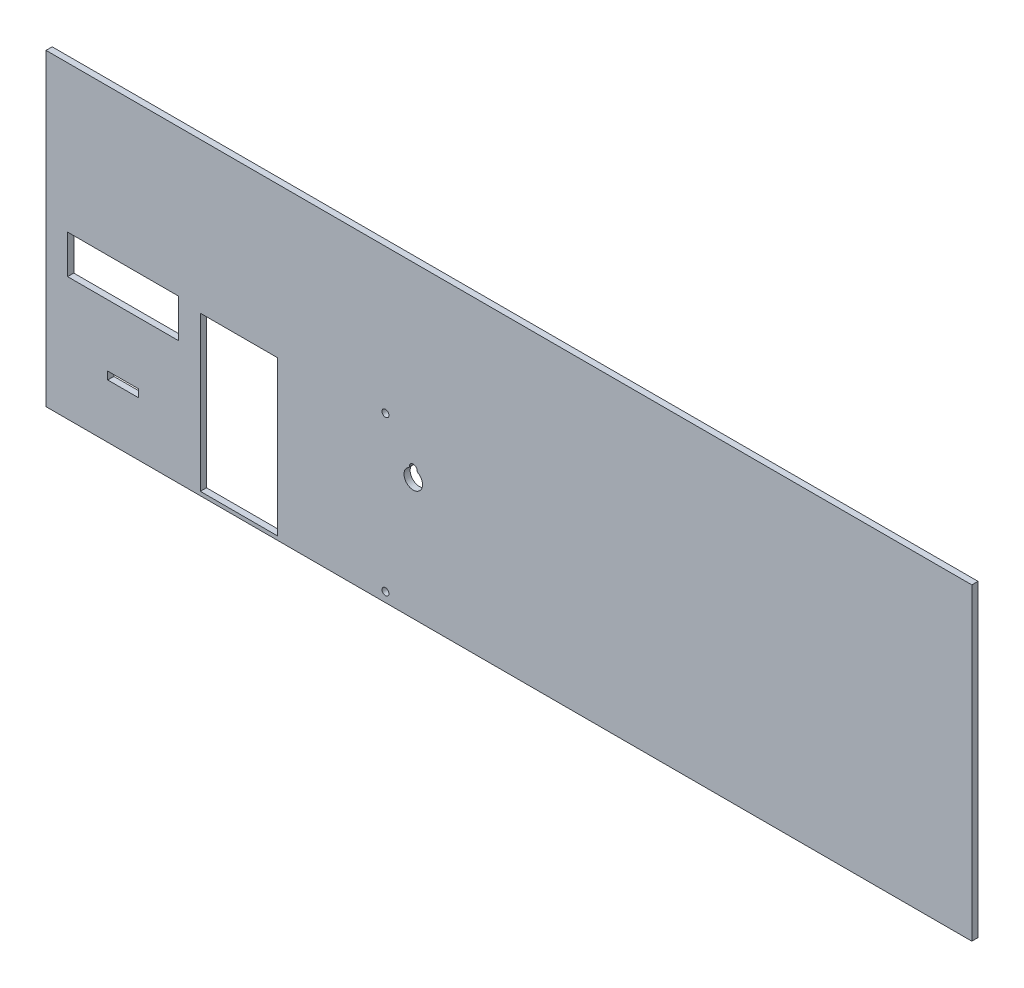
ISO-10303-21;
HEADER;
FILE_DESCRIPTION(('STEP AP214'),'2;1');
FILE_NAME('part.step','',(''),(''),'','','');
FILE_SCHEMA(('AUTOMOTIVE_DESIGN { 1 0 10303 214 1 1 1 1 }'));
ENDSEC;
DATA;
#1=APPLICATION_CONTEXT('core data for automotive mechanical design processes');
#2=APPLICATION_PROTOCOL_DEFINITION('international standard','automotive_design',2000,#1);
#3=PRODUCT_CONTEXT('',#1,'mechanical');
#4=PRODUCT('Part','Part','',(#3));
#5=PRODUCT_RELATED_PRODUCT_CATEGORY('part','',(#4));
#6=PRODUCT_DEFINITION_FORMATION('','',#4);
#7=PRODUCT_DEFINITION_CONTEXT('part definition',#1,'design');
#8=PRODUCT_DEFINITION('design','',#6,#7);
#9=PRODUCT_DEFINITION_SHAPE('','',#8);
#10=(LENGTH_UNIT() NAMED_UNIT(*) SI_UNIT(.MILLI.,.METRE.));
#11=(NAMED_UNIT(*) PLANE_ANGLE_UNIT() SI_UNIT($,.RADIAN.));
#12=(NAMED_UNIT(*) SI_UNIT($,.STERADIAN.) SOLID_ANGLE_UNIT());
#13=UNCERTAINTY_MEASURE_WITH_UNIT(LENGTH_MEASURE(1.E-05),#10,'distance_accuracy_value','');
#14=(GEOMETRIC_REPRESENTATION_CONTEXT(3) GLOBAL_UNCERTAINTY_ASSIGNED_CONTEXT((#13)) GLOBAL_UNIT_ASSIGNED_CONTEXT((#10,
#11,#12)) REPRESENTATION_CONTEXT('',''));
#15=CARTESIAN_POINT('',(0.,0.,0.));
#16=DIRECTION('',(0.,0.,1.));
#17=DIRECTION('',(1.,0.,0.));
#18=AXIS2_PLACEMENT_3D('',#15,#16,#17);
#19=CARTESIAN_POINT('',(0.,0.,4.));
#20=DIRECTION('',(0.,0.,-1.));
#21=DIRECTION('',(-1.,0.,0.));
#22=AXIS2_PLACEMENT_3D('',#19,#20,#21);
#23=PLANE('',#22);
#24=DIRECTION('',(0.,-1.,0.));
#25=VECTOR('',#24,1.);
#26=CARTESIAN_POINT('',(39.9999999999999,40.0000000000001,4.));
#27=LINE('',#26,#25);
#28=CARTESIAN_POINT('',(39.9999999999999,40.0000000000001,4.));
#29=VERTEX_POINT('',#28);
#30=CARTESIAN_POINT('',(39.9999999999999,35.0000000000001,4.));
#31=VERTEX_POINT('',#30);
#32=EDGE_CURVE('E205',#29,#31,#27,.T.);
#33=ORIENTED_EDGE('',*,*,#32,.F.);
#34=DIRECTION('',(-1.,0.,0.));
#35=VECTOR('',#34,1.);
#36=CARTESIAN_POINT('',(39.9999999999999,40.0000000000001,4.));
#37=LINE('',#36,#35);
#38=CARTESIAN_POINT('',(59.9999999999999,40.0000000000001,4.));
#39=VERTEX_POINT('',#38);
#40=EDGE_CURVE('E213',#39,#29,#37,.T.);
#41=ORIENTED_EDGE('',*,*,#40,.F.);
#42=DIRECTION('',(0.,1.,0.));
#43=VECTOR('',#42,1.);
#44=CARTESIAN_POINT('',(59.9999999999999,40.0000000000001,4.));
#45=LINE('',#44,#43);
#46=CARTESIAN_POINT('',(59.9999999999999,35.0000000000001,4.));
#47=VERTEX_POINT('',#46);
#48=EDGE_CURVE('E210',#47,#39,#45,.T.);
#49=ORIENTED_EDGE('',*,*,#48,.F.);
#50=DIRECTION('',(1.,0.,0.));
#51=VECTOR('',#50,1.);
#52=CARTESIAN_POINT('',(39.9999999999999,35.0000000000001,4.));
#53=LINE('',#52,#51);
#54=EDGE_CURVE('E207',#31,#47,#53,.T.);
#55=ORIENTED_EDGE('',*,*,#54,.F.);
#56=EDGE_LOOP('',(#33,#41,#49,#55));
#57=FACE_BOUND('',#56,.T.);
#58=CARTESIAN_POINT('',(220.,6.19033886971252,4.));
#59=DIRECTION('',(0.,0.,1.));
#60=DIRECTION('',(1.,0.,0.));
#61=AXIS2_PLACEMENT_3D('',#58,#59,#60);
#62=CIRCLE('',#61,2.25000000000001);
#63=CARTESIAN_POINT('',(222.25,6.19033886971252,4.));
#64=VERTEX_POINT('',#63);
#65=EDGE_CURVE('E267',#64,#64,#62,.T.);
#66=ORIENTED_EDGE('',*,*,#65,.F.);
#67=EDGE_LOOP('',(#66));
#68=FACE_BOUND('',#67,.T.);
#69=CARTESIAN_POINT('',(220.,106.309661130287,4.));
#70=DIRECTION('',(0.,0.,1.));
#71=DIRECTION('',(1.,0.,0.));
#72=AXIS2_PLACEMENT_3D('',#69,#70,#71);
#73=CIRCLE('',#72,2.25000000000001);
#74=CARTESIAN_POINT('',(222.25,106.309661130287,4.));
#75=VERTEX_POINT('',#74);
#76=EDGE_CURVE('E273',#75,#75,#73,.T.);
#77=ORIENTED_EDGE('',*,*,#76,.F.);
#78=EDGE_LOOP('',(#77));
#79=FACE_BOUND('',#78,.T.);
#80=DIRECTION('',(0.,1.,0.));
#81=VECTOR('',#80,1.);
#82=CARTESIAN_POINT('',(150.,102.5,4.));
#83=LINE('',#82,#81);
#84=CARTESIAN_POINT('',(150.,2.50000000000002,4.));
#85=VERTEX_POINT('',#84);
#86=CARTESIAN_POINT('',(150.,102.5,4.));
#87=VERTEX_POINT('',#86);
#88=EDGE_CURVE('E279',#85,#87,#83,.T.);
#89=ORIENTED_EDGE('',*,*,#88,.F.);
#90=DIRECTION('',(1.,0.,0.));
#91=VECTOR('',#90,1.);
#92=CARTESIAN_POINT('',(150.,2.50000000000002,4.));
#93=LINE('',#92,#91);
#94=CARTESIAN_POINT('',(99.9999999999999,2.50000000000001,4.));
#95=VERTEX_POINT('',#94);
#96=EDGE_CURVE('E287',#95,#85,#93,.T.);
#97=ORIENTED_EDGE('',*,*,#96,.F.);
#98=DIRECTION('',(0.,-1.,0.));
#99=VECTOR('',#98,1.);
#100=CARTESIAN_POINT('',(99.9999999999999,102.5,4.));
#101=LINE('',#100,#99);
#102=CARTESIAN_POINT('',(99.9999999999999,102.5,4.));
#103=VERTEX_POINT('',#102);
#104=EDGE_CURVE('E284',#103,#95,#101,.T.);
#105=ORIENTED_EDGE('',*,*,#104,.F.);
#106=DIRECTION('',(-1.,0.,0.));
#107=VECTOR('',#106,1.);
#108=CARTESIAN_POINT('',(150.,102.5,4.));
#109=LINE('',#108,#107);
#110=EDGE_CURVE('E281',#87,#103,#109,.T.);
#111=ORIENTED_EDGE('',*,*,#110,.F.);
#112=EDGE_LOOP('',(#89,#97,#105,#111));
#113=FACE_BOUND('',#112,.T.);
#114=DIRECTION('',(0.,1.,0.));
#115=VECTOR('',#114,1.);
#116=CARTESIAN_POINT('',(600.,200.,4.));
#117=LINE('',#116,#115);
#118=CARTESIAN_POINT('',(600.,0.,4.));
#119=VERTEX_POINT('',#118);
#120=CARTESIAN_POINT('',(600.,200.,4.));
#121=VERTEX_POINT('',#120);
#122=EDGE_CURVE('E310',#119,#121,#117,.T.);
#123=ORIENTED_EDGE('',*,*,#122,.T.);
#124=DIRECTION('',(-1.,0.,0.));
#125=VECTOR('',#124,1.);
#126=CARTESIAN_POINT('',(600.,200.,4.));
#127=LINE('',#126,#125);
#128=CARTESIAN_POINT('',(-1.11022302462516E-13,200.,4.));
#129=VERTEX_POINT('',#128);
#130=EDGE_CURVE('E313',#121,#129,#127,.T.);
#131=ORIENTED_EDGE('',*,*,#130,.T.);
#132=DIRECTION('',(0.,-1.,0.));
#133=VECTOR('',#132,1.);
#134=CARTESIAN_POINT('',(-1.11022302462516E-13,200.,4.));
#135=LINE('',#134,#133);
#136=CARTESIAN_POINT('',(0.,0.,4.));
#137=VERTEX_POINT('',#136);
#138=EDGE_CURVE('E316',#129,#137,#135,.T.);
#139=ORIENTED_EDGE('',*,*,#138,.T.);
#140=DIRECTION('',(1.,0.,0.));
#141=VECTOR('',#140,1.);
#142=CARTESIAN_POINT('',(600.,0.,4.));
#143=LINE('',#142,#141);
#144=EDGE_CURVE('E318',#137,#119,#143,.T.);
#145=ORIENTED_EDGE('',*,*,#144,.T.);
#146=EDGE_LOOP('',(#123,#131,#139,#145));
#147=FACE_BOUND('',#146,.T.);
#148=CARTESIAN_POINT('',(234.450154547818,84.233125,4.));
#149=DIRECTION('',(0.,0.,-1.));
#150=DIRECTION('',(1.,0.,0.));
#151=AXIS2_PLACEMENT_3D('',#148,#149,#150);
#152=CIRCLE('',#151,1.);
#153=CARTESIAN_POINT('',(235.450111013222,84.2237940140845,4.));
#154=VERTEX_POINT('',#153);
#155=CARTESIAN_POINT('',(234.957275326701,83.37125,4.));
#156=VERTEX_POINT('',#155);
#157=EDGE_CURVE('E236',#154,#156,#152,.T.);
#158=ORIENTED_EDGE('',*,*,#157,.F.);
#159=CARTESIAN_POINT('',(238.,84.2,4.));
#160=DIRECTION('',(0.,0.,1.));
#161=DIRECTION('',(1.,0.,0.));
#162=AXIS2_PLACEMENT_3D('',#159,#160,#161);
#163=CIRCLE('',#162,2.54999999999999);
#164=CARTESIAN_POINT('',(240.549888986778,84.2237940140845,4.));
#165=VERTEX_POINT('',#164);
#166=EDGE_CURVE('E244',#165,#154,#163,.T.);
#167=ORIENTED_EDGE('',*,*,#166,.F.);
#168=CARTESIAN_POINT('',(241.549845452182,84.233125,4.));
#169=DIRECTION('',(0.,0.,-1.));
#170=DIRECTION('',(1.,0.,0.));
#171=AXIS2_PLACEMENT_3D('',#168,#169,#170);
#172=CIRCLE('',#171,1.);
#173=CARTESIAN_POINT('',(241.042724673299,83.37125,4.));
#174=VERTEX_POINT('',#173);
#175=EDGE_CURVE('E241',#174,#165,#172,.T.);
#176=ORIENTED_EDGE('',*,*,#175,.F.);
#177=CARTESIAN_POINT('',(238.,78.2,4.));
#178=DIRECTION('',(0.,0.,1.));
#179=DIRECTION('',(1.,0.,0.));
#180=AXIS2_PLACEMENT_3D('',#177,#178,#179);
#181=CIRCLE('',#180,6.);
#182=EDGE_CURVE('E238',#156,#174,#181,.T.);
#183=ORIENTED_EDGE('',*,*,#182,.F.);
#184=EDGE_LOOP('',(#158,#167,#176,#183));
#185=FACE_BOUND('',#184,.T.);
#186=DIRECTION('',(0.,-1.,0.));
#187=VECTOR('',#186,1.);
#188=CARTESIAN_POINT('',(14.,105.,4.));
#189=LINE('',#188,#187);
#190=CARTESIAN_POINT('',(14.,105.,4.));
#191=VERTEX_POINT('',#190);
#192=CARTESIAN_POINT('',(14.,79.9999999999999,4.));
#193=VERTEX_POINT('',#192);
#194=EDGE_CURVE('E169',#191,#193,#189,.T.);
#195=ORIENTED_EDGE('',*,*,#194,.F.);
#196=DIRECTION('',(-1.,0.,0.));
#197=VECTOR('',#196,1.);
#198=CARTESIAN_POINT('',(14.,105.,4.));
#199=LINE('',#198,#197);
#200=CARTESIAN_POINT('',(86.,105.,4.));
#201=VERTEX_POINT('',#200);
#202=EDGE_CURVE('E191',#201,#191,#199,.T.);
#203=ORIENTED_EDGE('',*,*,#202,.F.);
#204=DIRECTION('',(0.,1.,0.));
#205=VECTOR('',#204,1.);
#206=CARTESIAN_POINT('',(86.,105.,4.));
#207=LINE('',#206,#205);
#208=CARTESIAN_POINT('',(86.,79.9999999999999,4.));
#209=VERTEX_POINT('',#208);
#210=EDGE_CURVE('E189',#209,#201,#207,.T.);
#211=ORIENTED_EDGE('',*,*,#210,.F.);
#212=DIRECTION('',(1.,0.,0.));
#213=VECTOR('',#212,1.);
#214=CARTESIAN_POINT('',(14.,79.9999999999999,4.));
#215=LINE('',#214,#213);
#216=EDGE_CURVE('E177',#193,#209,#215,.T.);
#217=ORIENTED_EDGE('',*,*,#216,.F.);
#218=EDGE_LOOP('',(#195,#203,#211,#217));
#219=FACE_BOUND('',#218,.T.);
#220=ADVANCED_FACE('F32',(#57,#68,#79,#113,#147,#185,#219),#23,.F.);
#221=CARTESIAN_POINT('',(0.,0.,0.));
#222=DIRECTION('',(0.,0.,-1.));
#223=DIRECTION('',(-1.,0.,0.));
#224=AXIS2_PLACEMENT_3D('',#221,#222,#223);
#225=PLANE('',#224);
#226=CARTESIAN_POINT('',(220.,106.309661130287,0.));
#227=DIRECTION('',(0.,0.,1.));
#228=DIRECTION('',(1.,0.,0.));
#229=AXIS2_PLACEMENT_3D('',#226,#227,#228);
#230=CIRCLE('',#229,2.25000000000001);
#231=CARTESIAN_POINT('',(222.25,106.309661130287,0.));
#232=VERTEX_POINT('',#231);
#233=EDGE_CURVE('E270',#232,#232,#230,.T.);
#234=ORIENTED_EDGE('',*,*,#233,.T.);
#235=EDGE_LOOP('',(#234));
#236=FACE_BOUND('',#235,.T.);
#237=DIRECTION('',(0.,1.,0.));
#238=VECTOR('',#237,1.);
#239=CARTESIAN_POINT('',(600.,200.,0.));
#240=LINE('',#239,#238);
#241=CARTESIAN_POINT('',(600.,0.,0.));
#242=VERTEX_POINT('',#241);
#243=CARTESIAN_POINT('',(600.,200.,0.));
#244=VERTEX_POINT('',#243);
#245=EDGE_CURVE('E309',#242,#244,#240,.T.);
#246=ORIENTED_EDGE('',*,*,#245,.F.);
#247=DIRECTION('',(1.,0.,0.));
#248=VECTOR('',#247,1.);
#249=CARTESIAN_POINT('',(600.,0.,0.));
#250=LINE('',#249,#248);
#251=CARTESIAN_POINT('',(0.,0.,0.));
#252=VERTEX_POINT('',#251);
#253=EDGE_CURVE('E314',#252,#242,#250,.T.);
#254=ORIENTED_EDGE('',*,*,#253,.F.);
#255=DIRECTION('',(0.,-1.,0.));
#256=VECTOR('',#255,1.);
#257=CARTESIAN_POINT('',(-1.11022302462516E-13,200.,0.));
#258=LINE('',#257,#256);
#259=CARTESIAN_POINT('',(-1.11022302462516E-13,200.,0.));
#260=VERTEX_POINT('',#259);
#261=EDGE_CURVE('E325',#260,#252,#258,.T.);
#262=ORIENTED_EDGE('',*,*,#261,.F.);
#263=DIRECTION('',(-1.,0.,0.));
#264=VECTOR('',#263,1.);
#265=CARTESIAN_POINT('',(600.,200.,0.));
#266=LINE('',#265,#264);
#267=EDGE_CURVE('E323',#244,#260,#266,.T.);
#268=ORIENTED_EDGE('',*,*,#267,.F.);
#269=EDGE_LOOP('',(#246,#254,#262,#268));
#270=FACE_BOUND('',#269,.T.);
#271=DIRECTION('',(1.,0.,0.));
#272=VECTOR('',#271,1.);
#273=CARTESIAN_POINT('',(150.,2.50000000000002,0.));
#274=LINE('',#273,#272);
#275=CARTESIAN_POINT('',(99.9999999999999,2.50000000000001,0.));
#276=VERTEX_POINT('',#275);
#277=CARTESIAN_POINT('',(150.,2.50000000000002,0.));
#278=VERTEX_POINT('',#277);
#279=EDGE_CURVE('E282',#276,#278,#274,.T.);
#280=ORIENTED_EDGE('',*,*,#279,.T.);
#281=DIRECTION('',(0.,1.,0.));
#282=VECTOR('',#281,1.);
#283=CARTESIAN_POINT('',(150.,102.5,0.));
#284=LINE('',#283,#282);
#285=CARTESIAN_POINT('',(150.,102.5,0.));
#286=VERTEX_POINT('',#285);
#287=EDGE_CURVE('E276',#278,#286,#284,.T.);
#288=ORIENTED_EDGE('',*,*,#287,.T.);
#289=DIRECTION('',(-1.,0.,0.));
#290=VECTOR('',#289,1.);
#291=CARTESIAN_POINT('',(150.,102.5,0.));
#292=LINE('',#291,#290);
#293=CARTESIAN_POINT('',(99.9999999999999,102.5,0.));
#294=VERTEX_POINT('',#293);
#295=EDGE_CURVE('E292',#286,#294,#292,.T.);
#296=ORIENTED_EDGE('',*,*,#295,.T.);
#297=DIRECTION('',(0.,-1.,0.));
#298=VECTOR('',#297,1.);
#299=CARTESIAN_POINT('',(99.9999999999999,102.5,0.));
#300=LINE('',#299,#298);
#301=EDGE_CURVE('E295',#294,#276,#300,.T.);
#302=ORIENTED_EDGE('',*,*,#301,.T.);
#303=EDGE_LOOP('',(#280,#288,#296,#302));
#304=FACE_BOUND('',#303,.T.);
#305=CARTESIAN_POINT('',(220.,6.19033886971252,0.));
#306=DIRECTION('',(0.,0.,1.));
#307=DIRECTION('',(1.,0.,0.));
#308=AXIS2_PLACEMENT_3D('',#305,#306,#307);
#309=CIRCLE('',#308,2.25000000000001);
#310=CARTESIAN_POINT('',(222.25,6.19033886971252,0.));
#311=VERTEX_POINT('',#310);
#312=EDGE_CURVE('E266',#311,#311,#309,.T.);
#313=ORIENTED_EDGE('',*,*,#312,.T.);
#314=EDGE_LOOP('',(#313));
#315=FACE_BOUND('',#314,.T.);
#316=CARTESIAN_POINT('',(238.,84.2,0.));
#317=DIRECTION('',(0.,0.,1.));
#318=DIRECTION('',(1.,0.,0.));
#319=AXIS2_PLACEMENT_3D('',#316,#317,#318);
#320=CIRCLE('',#319,2.54999999999999);
#321=CARTESIAN_POINT('',(240.549888986778,84.2237940140845,0.));
#322=VERTEX_POINT('',#321);
#323=CARTESIAN_POINT('',(235.450111013222,84.2237940140845,0.));
#324=VERTEX_POINT('',#323);
#325=EDGE_CURVE('E239',#322,#324,#320,.T.);
#326=ORIENTED_EDGE('',*,*,#325,.T.);
#327=CARTESIAN_POINT('',(234.450154547818,84.233125,0.));
#328=DIRECTION('',(0.,0.,-1.));
#329=DIRECTION('',(1.,0.,0.));
#330=AXIS2_PLACEMENT_3D('',#327,#328,#329);
#331=CIRCLE('',#330,1.);
#332=CARTESIAN_POINT('',(234.957275326701,83.37125,0.));
#333=VERTEX_POINT('',#332);
#334=EDGE_CURVE('E235',#324,#333,#331,.T.);
#335=ORIENTED_EDGE('',*,*,#334,.T.);
#336=CARTESIAN_POINT('',(238.,78.2,0.));
#337=DIRECTION('',(0.,0.,1.));
#338=DIRECTION('',(1.,0.,0.));
#339=AXIS2_PLACEMENT_3D('',#336,#337,#338);
#340=CIRCLE('',#339,6.);
#341=CARTESIAN_POINT('',(241.042724673299,83.37125,0.));
#342=VERTEX_POINT('',#341);
#343=EDGE_CURVE('E249',#333,#342,#340,.T.);
#344=ORIENTED_EDGE('',*,*,#343,.T.);
#345=CARTESIAN_POINT('',(241.549845452182,84.233125,0.));
#346=DIRECTION('',(0.,0.,-1.));
#347=DIRECTION('',(1.,0.,0.));
#348=AXIS2_PLACEMENT_3D('',#345,#346,#347);
#349=CIRCLE('',#348,1.);
#350=EDGE_CURVE('E252',#342,#322,#349,.T.);
#351=ORIENTED_EDGE('',*,*,#350,.T.);
#352=EDGE_LOOP('',(#326,#335,#344,#351));
#353=FACE_BOUND('',#352,.T.);
#354=DIRECTION('',(-1.,0.,0.));
#355=VECTOR('',#354,1.);
#356=CARTESIAN_POINT('',(39.9999999999999,40.0000000000001,0.));
#357=LINE('',#356,#355);
#358=CARTESIAN_POINT('',(59.9999999999999,40.0000000000001,0.));
#359=VERTEX_POINT('',#358);
#360=CARTESIAN_POINT('',(39.9999999999999,40.0000000000001,0.));
#361=VERTEX_POINT('',#360);
#362=EDGE_CURVE('E208',#359,#361,#357,.T.);
#363=ORIENTED_EDGE('',*,*,#362,.T.);
#364=DIRECTION('',(0.,-1.,0.));
#365=VECTOR('',#364,1.);
#366=CARTESIAN_POINT('',(39.9999999999999,40.0000000000001,0.));
#367=LINE('',#366,#365);
#368=CARTESIAN_POINT('',(39.9999999999999,35.0000000000001,0.));
#369=VERTEX_POINT('',#368);
#370=EDGE_CURVE('E185',#361,#369,#367,.T.);
#371=ORIENTED_EDGE('',*,*,#370,.T.);
#372=DIRECTION('',(1.,0.,0.));
#373=VECTOR('',#372,1.);
#374=CARTESIAN_POINT('',(39.9999999999999,35.0000000000001,0.));
#375=LINE('',#374,#373);
#376=CARTESIAN_POINT('',(59.9999999999999,35.0000000000001,0.));
#377=VERTEX_POINT('',#376);
#378=EDGE_CURVE('E218',#369,#377,#375,.T.);
#379=ORIENTED_EDGE('',*,*,#378,.T.);
#380=DIRECTION('',(0.,1.,0.));
#381=VECTOR('',#380,1.);
#382=CARTESIAN_POINT('',(59.9999999999999,40.0000000000001,0.));
#383=LINE('',#382,#381);
#384=EDGE_CURVE('E221',#377,#359,#383,.T.);
#385=ORIENTED_EDGE('',*,*,#384,.T.);
#386=EDGE_LOOP('',(#363,#371,#379,#385));
#387=FACE_BOUND('',#386,.T.);
#388=DIRECTION('',(-1.,0.,0.));
#389=VECTOR('',#388,1.);
#390=CARTESIAN_POINT('',(14.,105.,0.));
#391=LINE('',#390,#389);
#392=CARTESIAN_POINT('',(86.,105.,0.));
#393=VERTEX_POINT('',#392);
#394=CARTESIAN_POINT('',(14.,105.,0.));
#395=VERTEX_POINT('',#394);
#396=EDGE_CURVE('E178',#393,#395,#391,.T.);
#397=ORIENTED_EDGE('',*,*,#396,.T.);
#398=DIRECTION('',(0.,-1.,0.));
#399=VECTOR('',#398,1.);
#400=CARTESIAN_POINT('',(14.,105.,0.));
#401=LINE('',#400,#399);
#402=CARTESIAN_POINT('',(14.,79.9999999999999,0.));
#403=VERTEX_POINT('',#402);
#404=EDGE_CURVE('E55',#395,#403,#401,.T.);
#405=ORIENTED_EDGE('',*,*,#404,.T.);
#406=DIRECTION('',(1.,0.,0.));
#407=VECTOR('',#406,1.);
#408=CARTESIAN_POINT('',(14.,79.9999999999999,0.));
#409=LINE('',#408,#407);
#410=CARTESIAN_POINT('',(86.,79.9999999999999,0.));
#411=VERTEX_POINT('',#410);
#412=EDGE_CURVE('E184',#403,#411,#409,.T.);
#413=ORIENTED_EDGE('',*,*,#412,.T.);
#414=DIRECTION('',(0.,1.,0.));
#415=VECTOR('',#414,1.);
#416=CARTESIAN_POINT('',(86.,105.,0.));
#417=LINE('',#416,#415);
#418=EDGE_CURVE('E197',#411,#393,#417,.T.);
#419=ORIENTED_EDGE('',*,*,#418,.T.);
#420=EDGE_LOOP('',(#397,#405,#413,#419));
#421=FACE_BOUND('',#420,.T.);
#422=ADVANCED_FACE('F343',(#236,#270,#304,#315,#353,#387,#421),#225,.T.);
#423=CARTESIAN_POINT('',(600.,200.,4.));
#424=DIRECTION('',(-1.,0.,0.));
#425=DIRECTION('',(0.,0.,1.));
#426=AXIS2_PLACEMENT_3D('',#423,#424,#425);
#427=PLANE('',#426);
#428=ORIENTED_EDGE('',*,*,#245,.T.);
#429=DIRECTION('',(0.,0.,-1.));
#430=VECTOR('',#429,1.);
#431=CARTESIAN_POINT('',(600.,200.,4.));
#432=LINE('',#431,#430);
#433=EDGE_CURVE('E11',#121,#244,#432,.T.);
#434=ORIENTED_EDGE('',*,*,#433,.F.);
#435=ORIENTED_EDGE('',*,*,#122,.F.);
#436=DIRECTION('',(0.,0.,-1.));
#437=VECTOR('',#436,1.);
#438=CARTESIAN_POINT('',(600.,0.,4.));
#439=LINE('',#438,#437);
#440=EDGE_CURVE('E320',#119,#242,#439,.T.);
#441=ORIENTED_EDGE('',*,*,#440,.T.);
#442=EDGE_LOOP('',(#428,#434,#435,#441));
#443=FACE_BOUND('',#442,.T.);
#444=ADVANCED_FACE('F34',(#443),#427,.F.);
#445=CARTESIAN_POINT('',(600.,200.,4.));
#446=DIRECTION('',(0.,-1.,0.));
#447=DIRECTION('',(1.,0.,0.));
#448=AXIS2_PLACEMENT_3D('',#445,#446,#447);
#449=PLANE('',#448);
#450=ORIENTED_EDGE('',*,*,#267,.T.);
#451=DIRECTION('',(0.,0.,-1.));
#452=VECTOR('',#451,1.);
#453=CARTESIAN_POINT('',(-1.11022302462516E-13,200.,4.));
#454=LINE('',#453,#452);
#455=EDGE_CURVE('E40',#129,#260,#454,.T.);
#456=ORIENTED_EDGE('',*,*,#455,.F.);
#457=ORIENTED_EDGE('',*,*,#130,.F.);
#458=ORIENTED_EDGE('',*,*,#433,.T.);
#459=EDGE_LOOP('',(#450,#456,#457,#458));
#460=FACE_BOUND('',#459,.T.);
#461=ADVANCED_FACE('F354',(#460),#449,.F.);
#462=CARTESIAN_POINT('',(-1.11022302462516E-13,200.,4.));
#463=DIRECTION('',(1.,0.,0.));
#464=DIRECTION('',(0.,1.,0.));
#465=AXIS2_PLACEMENT_3D('',#462,#463,#464);
#466=PLANE('',#465);
#467=ORIENTED_EDGE('',*,*,#261,.T.);
#468=DIRECTION('',(0.,0.,-1.));
#469=VECTOR('',#468,1.);
#470=CARTESIAN_POINT('',(0.,0.,4.));
#471=LINE('',#470,#469);
#472=EDGE_CURVE('E330',#137,#252,#471,.T.);
#473=ORIENTED_EDGE('',*,*,#472,.F.);
#474=ORIENTED_EDGE('',*,*,#138,.F.);
#475=ORIENTED_EDGE('',*,*,#455,.T.);
#476=EDGE_LOOP('',(#467,#473,#474,#475));
#477=FACE_BOUND('',#476,.T.);
#478=ADVANCED_FACE('F337',(#477),#466,.F.);
#479=CARTESIAN_POINT('',(600.,0.,4.));
#480=DIRECTION('',(0.,1.,0.));
#481=DIRECTION('',(-1.,0.,0.));
#482=AXIS2_PLACEMENT_3D('',#479,#480,#481);
#483=PLANE('',#482);
#484=ORIENTED_EDGE('',*,*,#253,.T.);
#485=ORIENTED_EDGE('',*,*,#440,.F.);
#486=ORIENTED_EDGE('',*,*,#144,.F.);
#487=ORIENTED_EDGE('',*,*,#472,.T.);
#488=EDGE_LOOP('',(#484,#485,#486,#487));
#489=FACE_BOUND('',#488,.T.);
#490=ADVANCED_FACE('F347',(#489),#483,.F.);
#491=CARTESIAN_POINT('',(150.,102.5,4.));
#492=DIRECTION('',(-1.,0.,0.));
#493=DIRECTION('',(0.,-1.,0.));
#494=AXIS2_PLACEMENT_3D('',#491,#492,#493);
#495=PLANE('',#494);
#496=ORIENTED_EDGE('',*,*,#287,.F.);
#497=DIRECTION('',(0.,0.,-1.));
#498=VECTOR('',#497,1.);
#499=CARTESIAN_POINT('',(150.,2.50000000000002,4.));
#500=LINE('',#499,#498);
#501=EDGE_CURVE('E289',#85,#278,#500,.T.);
#502=ORIENTED_EDGE('',*,*,#501,.F.);
#503=ORIENTED_EDGE('',*,*,#88,.T.);
#504=DIRECTION('',(0.,0.,-1.));
#505=VECTOR('',#504,1.);
#506=CARTESIAN_POINT('',(150.,102.5,4.));
#507=LINE('',#506,#505);
#508=EDGE_CURVE('E306',#87,#286,#507,.T.);
#509=ORIENTED_EDGE('',*,*,#508,.T.);
#510=EDGE_LOOP('',(#496,#502,#503,#509));
#511=FACE_BOUND('',#510,.T.);
#512=ADVANCED_FACE('F372',(#511),#495,.T.);
#513=CARTESIAN_POINT('',(150.,102.5,4.));
#514=DIRECTION('',(0.,-1.,0.));
#515=DIRECTION('',(1.,0.,0.));
#516=AXIS2_PLACEMENT_3D('',#513,#514,#515);
#517=PLANE('',#516);
#518=ORIENTED_EDGE('',*,*,#295,.F.);
#519=ORIENTED_EDGE('',*,*,#508,.F.);
#520=ORIENTED_EDGE('',*,*,#110,.T.);
#521=DIRECTION('',(0.,0.,-1.));
#522=VECTOR('',#521,1.);
#523=CARTESIAN_POINT('',(99.9999999999999,102.5,4.));
#524=LINE('',#523,#522);
#525=EDGE_CURVE('E304',#103,#294,#524,.T.);
#526=ORIENTED_EDGE('',*,*,#525,.T.);
#527=EDGE_LOOP('',(#518,#519,#520,#526));
#528=FACE_BOUND('',#527,.T.);
#529=ADVANCED_FACE('F379',(#528),#517,.T.);
#530=CARTESIAN_POINT('',(99.9999999999999,102.5,4.));
#531=DIRECTION('',(1.,0.,0.));
#532=DIRECTION('',(0.,1.,0.));
#533=AXIS2_PLACEMENT_3D('',#530,#531,#532);
#534=PLANE('',#533);
#535=ORIENTED_EDGE('',*,*,#301,.F.);
#536=ORIENTED_EDGE('',*,*,#525,.F.);
#537=ORIENTED_EDGE('',*,*,#104,.T.);
#538=DIRECTION('',(0.,0.,-1.));
#539=VECTOR('',#538,1.);
#540=CARTESIAN_POINT('',(99.9999999999999,2.50000000000001,4.));
#541=LINE('',#540,#539);
#542=EDGE_CURVE('E302',#95,#276,#541,.T.);
#543=ORIENTED_EDGE('',*,*,#542,.T.);
#544=EDGE_LOOP('',(#535,#536,#537,#543));
#545=FACE_BOUND('',#544,.T.);
#546=ADVANCED_FACE('F384',(#545),#534,.T.);
#547=CARTESIAN_POINT('',(150.,2.50000000000002,4.));
#548=DIRECTION('',(0.,1.,0.));
#549=DIRECTION('',(-1.,0.,0.));
#550=AXIS2_PLACEMENT_3D('',#547,#548,#549);
#551=PLANE('',#550);
#552=ORIENTED_EDGE('',*,*,#279,.F.);
#553=ORIENTED_EDGE('',*,*,#542,.F.);
#554=ORIENTED_EDGE('',*,*,#96,.T.);
#555=ORIENTED_EDGE('',*,*,#501,.T.);
#556=EDGE_LOOP('',(#552,#553,#554,#555));
#557=FACE_BOUND('',#556,.T.);
#558=ADVANCED_FACE('F391',(#557),#551,.T.);
#559=CARTESIAN_POINT('',(220.,106.309661130287,4.));
#560=DIRECTION('',(0.,0.,-1.));
#561=DIRECTION('',(-1.,0.,0.));
#562=AXIS2_PLACEMENT_3D('',#559,#560,#561);
#563=CYLINDRICAL_SURFACE('',#562,2.25000000000001);
#564=ORIENTED_EDGE('',*,*,#76,.T.);
#565=EDGE_LOOP('',(#564));
#566=FACE_BOUND('',#565,.T.);
#567=ORIENTED_EDGE('',*,*,#233,.F.);
#568=EDGE_LOOP('',(#567));
#569=FACE_BOUND('',#568,.T.);
#570=ADVANCED_FACE('F405',(#566,#569),#563,.F.);
#571=CARTESIAN_POINT('',(220.,6.19033886971252,4.));
#572=DIRECTION('',(0.,0.,-1.));
#573=DIRECTION('',(-1.,0.,0.));
#574=AXIS2_PLACEMENT_3D('',#571,#572,#573);
#575=CYLINDRICAL_SURFACE('',#574,2.25000000000001);
#576=ORIENTED_EDGE('',*,*,#65,.T.);
#577=EDGE_LOOP('',(#576));
#578=FACE_BOUND('',#577,.T.);
#579=ORIENTED_EDGE('',*,*,#312,.F.);
#580=EDGE_LOOP('',(#579));
#581=FACE_BOUND('',#580,.T.);
#582=ADVANCED_FACE('F410',(#578,#581),#575,.F.);
#583=CARTESIAN_POINT('',(234.450154547818,84.233125,4.));
#584=DIRECTION('',(0.,0.,-1.));
#585=DIRECTION('',(-1.,0.,0.));
#586=AXIS2_PLACEMENT_3D('',#583,#584,#585);
#587=CYLINDRICAL_SURFACE('',#586,1.);
#588=ORIENTED_EDGE('',*,*,#334,.F.);
#589=DIRECTION('',(0.,0.,-1.));
#590=VECTOR('',#589,1.);
#591=CARTESIAN_POINT('',(235.450111013222,84.2237940140845,4.));
#592=LINE('',#591,#590);
#593=EDGE_CURVE('E246',#154,#324,#592,.T.);
#594=ORIENTED_EDGE('',*,*,#593,.F.);
#595=ORIENTED_EDGE('',*,*,#157,.T.);
#596=DIRECTION('',(0.,0.,-1.));
#597=VECTOR('',#596,1.);
#598=CARTESIAN_POINT('',(234.957275326701,83.37125,4.));
#599=LINE('',#598,#597);
#600=EDGE_CURVE('E263',#156,#333,#599,.T.);
#601=ORIENTED_EDGE('',*,*,#600,.T.);
#602=EDGE_LOOP('',(#588,#594,#595,#601));
#603=FACE_BOUND('',#602,.T.);
#604=ADVANCED_FACE('F414',(#603),#587,.T.);
#605=CARTESIAN_POINT('',(238.,78.2,4.));
#606=DIRECTION('',(0.,0.,-1.));
#607=DIRECTION('',(-1.,0.,0.));
#608=AXIS2_PLACEMENT_3D('',#605,#606,#607);
#609=CYLINDRICAL_SURFACE('',#608,6.);
#610=ORIENTED_EDGE('',*,*,#343,.F.);
#611=ORIENTED_EDGE('',*,*,#600,.F.);
#612=ORIENTED_EDGE('',*,*,#182,.T.);
#613=DIRECTION('',(0.,0.,-1.));
#614=VECTOR('',#613,1.);
#615=CARTESIAN_POINT('',(241.042724673299,83.37125,4.));
#616=LINE('',#615,#614);
#617=EDGE_CURVE('E261',#174,#342,#616,.T.);
#618=ORIENTED_EDGE('',*,*,#617,.T.);
#619=EDGE_LOOP('',(#610,#611,#612,#618));
#620=FACE_BOUND('',#619,.T.);
#621=ADVANCED_FACE('F418',(#620),#609,.F.);
#622=CARTESIAN_POINT('',(241.549845452182,84.233125,4.));
#623=DIRECTION('',(0.,0.,-1.));
#624=DIRECTION('',(-1.,0.,0.));
#625=AXIS2_PLACEMENT_3D('',#622,#623,#624);
#626=CYLINDRICAL_SURFACE('',#625,1.);
#627=ORIENTED_EDGE('',*,*,#350,.F.);
#628=ORIENTED_EDGE('',*,*,#617,.F.);
#629=ORIENTED_EDGE('',*,*,#175,.T.);
#630=DIRECTION('',(0.,0.,-1.));
#631=VECTOR('',#630,1.);
#632=CARTESIAN_POINT('',(240.549888986778,84.2237940140845,4.));
#633=LINE('',#632,#631);
#634=EDGE_CURVE('E259',#165,#322,#633,.T.);
#635=ORIENTED_EDGE('',*,*,#634,.T.);
#636=EDGE_LOOP('',(#627,#628,#629,#635));
#637=FACE_BOUND('',#636,.T.);
#638=ADVANCED_FACE('F422',(#637),#626,.T.);
#639=CARTESIAN_POINT('',(238.,84.2,4.));
#640=DIRECTION('',(0.,0.,-1.));
#641=DIRECTION('',(-1.,0.,0.));
#642=AXIS2_PLACEMENT_3D('',#639,#640,#641);
#643=CYLINDRICAL_SURFACE('',#642,2.54999999999999);
#644=ORIENTED_EDGE('',*,*,#325,.F.);
#645=ORIENTED_EDGE('',*,*,#634,.F.);
#646=ORIENTED_EDGE('',*,*,#166,.T.);
#647=ORIENTED_EDGE('',*,*,#593,.T.);
#648=EDGE_LOOP('',(#644,#645,#646,#647));
#649=FACE_BOUND('',#648,.T.);
#650=ADVANCED_FACE('F426',(#649),#643,.F.);
#651=CARTESIAN_POINT('',(39.9999999999999,40.0000000000001,4.));
#652=DIRECTION('',(1.,0.,0.));
#653=DIRECTION('',(0.,0.,-1.));
#654=AXIS2_PLACEMENT_3D('',#651,#652,#653);
#655=PLANE('',#654);
#656=ORIENTED_EDGE('',*,*,#370,.F.);
#657=DIRECTION('',(0.,0.,-1.));
#658=VECTOR('',#657,1.);
#659=CARTESIAN_POINT('',(39.9999999999999,40.0000000000001,4.));
#660=LINE('',#659,#658);
#661=EDGE_CURVE('E215',#29,#361,#660,.T.);
#662=ORIENTED_EDGE('',*,*,#661,.F.);
#663=ORIENTED_EDGE('',*,*,#32,.T.);
#664=DIRECTION('',(0.,0.,-1.));
#665=VECTOR('',#664,1.);
#666=CARTESIAN_POINT('',(39.9999999999999,35.0000000000001,4.));
#667=LINE('',#666,#665);
#668=EDGE_CURVE('E232',#31,#369,#667,.T.);
#669=ORIENTED_EDGE('',*,*,#668,.T.);
#670=EDGE_LOOP('',(#656,#662,#663,#669));
#671=FACE_BOUND('',#670,.T.);
#672=ADVANCED_FACE('F430',(#671),#655,.T.);
#673=CARTESIAN_POINT('',(39.9999999999999,35.0000000000001,4.));
#674=DIRECTION('',(0.,1.,0.));
#675=DIRECTION('',(-1.,0.,0.));
#676=AXIS2_PLACEMENT_3D('',#673,#674,#675);
#677=PLANE('',#676);
#678=ORIENTED_EDGE('',*,*,#378,.F.);
#679=ORIENTED_EDGE('',*,*,#668,.F.);
#680=ORIENTED_EDGE('',*,*,#54,.T.);
#681=DIRECTION('',(0.,0.,-1.));
#682=VECTOR('',#681,1.);
#683=CARTESIAN_POINT('',(59.9999999999999,35.0000000000001,4.));
#684=LINE('',#683,#682);
#685=EDGE_CURVE('E230',#47,#377,#684,.T.);
#686=ORIENTED_EDGE('',*,*,#685,.T.);
#687=EDGE_LOOP('',(#678,#679,#680,#686));
#688=FACE_BOUND('',#687,.T.);
#689=ADVANCED_FACE('F434',(#688),#677,.T.);
#690=CARTESIAN_POINT('',(59.9999999999999,40.0000000000001,4.));
#691=DIRECTION('',(-1.,0.,0.));
#692=DIRECTION('',(0.,0.,1.));
#693=AXIS2_PLACEMENT_3D('',#690,#691,#692);
#694=PLANE('',#693);
#695=ORIENTED_EDGE('',*,*,#384,.F.);
#696=ORIENTED_EDGE('',*,*,#685,.F.);
#697=ORIENTED_EDGE('',*,*,#48,.T.);
#698=DIRECTION('',(0.,0.,-1.));
#699=VECTOR('',#698,1.);
#700=CARTESIAN_POINT('',(59.9999999999999,40.0000000000001,4.));
#701=LINE('',#700,#699);
#702=EDGE_CURVE('E228',#39,#359,#701,.T.);
#703=ORIENTED_EDGE('',*,*,#702,.T.);
#704=EDGE_LOOP('',(#695,#696,#697,#703));
#705=FACE_BOUND('',#704,.T.);
#706=ADVANCED_FACE('F438',(#705),#694,.T.);
#707=CARTESIAN_POINT('',(39.9999999999999,40.0000000000001,4.));
#708=DIRECTION('',(0.,-1.,0.));
#709=DIRECTION('',(1.,0.,0.));
#710=AXIS2_PLACEMENT_3D('',#707,#708,#709);
#711=PLANE('',#710);
#712=ORIENTED_EDGE('',*,*,#362,.F.);
#713=ORIENTED_EDGE('',*,*,#702,.F.);
#714=ORIENTED_EDGE('',*,*,#40,.T.);
#715=ORIENTED_EDGE('',*,*,#661,.T.);
#716=EDGE_LOOP('',(#712,#713,#714,#715));
#717=FACE_BOUND('',#716,.T.);
#718=ADVANCED_FACE('F442',(#717),#711,.T.);
#719=CARTESIAN_POINT('',(14.,105.,4.));
#720=DIRECTION('',(1.,0.,0.));
#721=DIRECTION('',(0.,1.,0.));
#722=AXIS2_PLACEMENT_3D('',#719,#720,#721);
#723=PLANE('',#722);
#724=ORIENTED_EDGE('',*,*,#404,.F.);
#725=DIRECTION('',(0.,0.,-1.));
#726=VECTOR('',#725,1.);
#727=CARTESIAN_POINT('',(14.,105.,4.));
#728=LINE('',#727,#726);
#729=EDGE_CURVE('E173',#191,#395,#728,.T.);
#730=ORIENTED_EDGE('',*,*,#729,.F.);
#731=ORIENTED_EDGE('',*,*,#194,.T.);
#732=DIRECTION('',(0.,0.,-1.));
#733=VECTOR('',#732,1.);
#734=CARTESIAN_POINT('',(14.,79.9999999999999,4.));
#735=LINE('',#734,#733);
#736=EDGE_CURVE('E172',#193,#403,#735,.T.);
#737=ORIENTED_EDGE('',*,*,#736,.T.);
#738=EDGE_LOOP('',(#724,#730,#731,#737));
#739=FACE_BOUND('',#738,.T.);
#740=ADVANCED_FACE('F171',(#739),#723,.T.);
#741=CARTESIAN_POINT('',(14.,79.9999999999999,4.));
#742=DIRECTION('',(0.,1.,0.));
#743=DIRECTION('',(0.,0.,1.));
#744=AXIS2_PLACEMENT_3D('',#741,#742,#743);
#745=PLANE('',#744);
#746=ORIENTED_EDGE('',*,*,#412,.F.);
#747=ORIENTED_EDGE('',*,*,#736,.F.);
#748=ORIENTED_EDGE('',*,*,#216,.T.);
#749=DIRECTION('',(0.,0.,-1.));
#750=VECTOR('',#749,1.);
#751=CARTESIAN_POINT('',(86.,79.9999999999999,4.));
#752=LINE('',#751,#750);
#753=EDGE_CURVE('E186',#209,#411,#752,.T.);
#754=ORIENTED_EDGE('',*,*,#753,.T.);
#755=EDGE_LOOP('',(#746,#747,#748,#754));
#756=FACE_BOUND('',#755,.T.);
#757=ADVANCED_FACE('F181',(#756),#745,.T.);
#758=CARTESIAN_POINT('',(86.,105.,4.));
#759=DIRECTION('',(-1.,0.,0.));
#760=DIRECTION('',(0.,0.,1.));
#761=AXIS2_PLACEMENT_3D('',#758,#759,#760);
#762=PLANE('',#761);
#763=ORIENTED_EDGE('',*,*,#418,.F.);
#764=ORIENTED_EDGE('',*,*,#753,.F.);
#765=ORIENTED_EDGE('',*,*,#210,.T.);
#766=DIRECTION('',(0.,0.,-1.));
#767=VECTOR('',#766,1.);
#768=CARTESIAN_POINT('',(86.,105.,4.));
#769=LINE('',#768,#767);
#770=EDGE_CURVE('E47',#201,#393,#769,.T.);
#771=ORIENTED_EDGE('',*,*,#770,.T.);
#772=EDGE_LOOP('',(#763,#764,#765,#771));
#773=FACE_BOUND('',#772,.T.);
#774=ADVANCED_FACE('F451',(#773),#762,.T.);
#775=CARTESIAN_POINT('',(14.,105.,4.));
#776=DIRECTION('',(0.,-1.,0.));
#777=DIRECTION('',(0.,0.,-1.));
#778=AXIS2_PLACEMENT_3D('',#775,#776,#777);
#779=PLANE('',#778);
#780=ORIENTED_EDGE('',*,*,#396,.F.);
#781=ORIENTED_EDGE('',*,*,#770,.F.);
#782=ORIENTED_EDGE('',*,*,#202,.T.);
#783=ORIENTED_EDGE('',*,*,#729,.T.);
#784=EDGE_LOOP('',(#780,#781,#782,#783));
#785=FACE_BOUND('',#784,.T.);
#786=ADVANCED_FACE('F454',(#785),#779,.T.);
#787=CLOSED_SHELL('',(#220,#422,#444,#461,#478,#490,#512,#529,#546,#558,#570,#582,#604,#621,
#638,#650,#672,#689,#706,#718,#740,#757,#774,#786));
#788=MANIFOLD_SOLID_BREP('B2',#787);
#789=ADVANCED_BREP_SHAPE_REPRESENTATION('',(#18,#788),#14);
#790=SHAPE_DEFINITION_REPRESENTATION(#9,#789);
ENDSEC;
END-ISO-10303-21;
